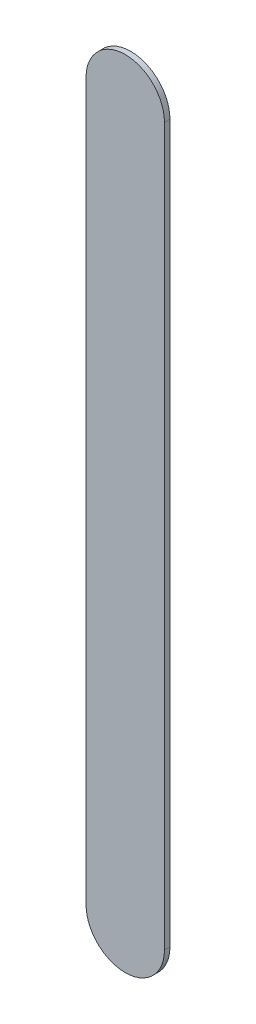
ISO-10303-21;
HEADER;
FILE_DESCRIPTION(('STEP AP214'),'2;1');
FILE_NAME('part.step','',(''),(''),'','','');
FILE_SCHEMA(('AUTOMOTIVE_DESIGN { 1 0 10303 214 1 1 1 1 }'));
ENDSEC;
DATA;
#1=APPLICATION_CONTEXT('core data for automotive mechanical design processes');
#2=APPLICATION_PROTOCOL_DEFINITION('international standard','automotive_design',2000,#1);
#3=PRODUCT_CONTEXT('',#1,'mechanical');
#4=PRODUCT('Part','Part','',(#3));
#5=PRODUCT_RELATED_PRODUCT_CATEGORY('part','',(#4));
#6=PRODUCT_DEFINITION_FORMATION('','',#4);
#7=PRODUCT_DEFINITION_CONTEXT('part definition',#1,'design');
#8=PRODUCT_DEFINITION('design','',#6,#7);
#9=PRODUCT_DEFINITION_SHAPE('','',#8);
#10=(LENGTH_UNIT() NAMED_UNIT(*) SI_UNIT(.MILLI.,.METRE.));
#11=(NAMED_UNIT(*) PLANE_ANGLE_UNIT() SI_UNIT($,.RADIAN.));
#12=(NAMED_UNIT(*) SI_UNIT($,.STERADIAN.) SOLID_ANGLE_UNIT());
#13=UNCERTAINTY_MEASURE_WITH_UNIT(LENGTH_MEASURE(1.E-05),#10,'distance_accuracy_value','');
#14=(GEOMETRIC_REPRESENTATION_CONTEXT(3) GLOBAL_UNCERTAINTY_ASSIGNED_CONTEXT((#13)) GLOBAL_UNIT_ASSIGNED_CONTEXT((#10,
#11,#12)) REPRESENTATION_CONTEXT('',''));
#15=CARTESIAN_POINT('',(0.,0.,0.));
#16=DIRECTION('',(0.,0.,1.));
#17=DIRECTION('',(1.,0.,0.));
#18=AXIS2_PLACEMENT_3D('',#15,#16,#17);
#19=CARTESIAN_POINT('',(167.517,-126.365,0.));
#20=DIRECTION('',(0.,0.,1.));
#21=DIRECTION('',(1.,0.,0.));
#22=AXIS2_PLACEMENT_3D('',#19,#20,#21);
#23=PLANE('',#22);
#24=DIRECTION('',(0.,-1.,0.));
#25=VECTOR('',#24,1.);
#26=CARTESIAN_POINT('',(167.517,-126.365,0.));
#27=LINE('',#26,#25);
#28=CARTESIAN_POINT('',(167.517,-126.365,0.));
#29=VERTEX_POINT('',#28);
#30=CARTESIAN_POINT('',(167.517,-130.937,0.));
#31=VERTEX_POINT('',#30);
#32=EDGE_CURVE('E98',#29,#31,#27,.T.);
#33=ORIENTED_EDGE('',*,*,#32,.T.);
#34=CARTESIAN_POINT('',(167.767,-130.937,0.));
#35=DIRECTION('',(0.,0.,1.));
#36=DIRECTION('',(-1.,0.,0.));
#37=AXIS2_PLACEMENT_3D('',#34,#35,#36);
#38=CIRCLE('',#37,0.25);
#39=CARTESIAN_POINT('',(168.017,-130.937,0.));
#40=VERTEX_POINT('',#39);
#41=EDGE_CURVE('E77',#31,#40,#38,.T.);
#42=ORIENTED_EDGE('',*,*,#41,.T.);
#43=DIRECTION('',(0.,1.,0.));
#44=VECTOR('',#43,1.);
#45=CARTESIAN_POINT('',(168.017,-130.937,0.));
#46=LINE('',#45,#44);
#47=CARTESIAN_POINT('',(168.017,-126.365,0.));
#48=VERTEX_POINT('',#47);
#49=EDGE_CURVE('E82',#40,#48,#46,.T.);
#50=ORIENTED_EDGE('',*,*,#49,.T.);
#51=CARTESIAN_POINT('',(167.767,-126.365,0.));
#52=DIRECTION('',(0.,0.,1.));
#53=DIRECTION('',(1.,0.,0.));
#54=AXIS2_PLACEMENT_3D('',#51,#52,#53);
#55=CIRCLE('',#54,0.25);
#56=EDGE_CURVE('E11',#48,#29,#55,.T.);
#57=ORIENTED_EDGE('',*,*,#56,.T.);
#58=EDGE_LOOP('',(#33,#42,#50,#57));
#59=FACE_BOUND('',#58,.T.);
#60=ADVANCED_FACE('F17',(#59),#23,.T.);
#61=CARTESIAN_POINT('',(167.517,-126.365,-0.035));
#62=DIRECTION('',(0.,0.,1.));
#63=DIRECTION('',(1.,0.,0.));
#64=AXIS2_PLACEMENT_3D('',#61,#62,#63);
#65=PLANE('',#64);
#66=CARTESIAN_POINT('',(167.767,-126.365,-0.035));
#67=DIRECTION('',(0.,0.,1.));
#68=DIRECTION('',(1.,0.,0.));
#69=AXIS2_PLACEMENT_3D('',#66,#67,#68);
#70=CIRCLE('',#69,0.25);
#71=CARTESIAN_POINT('',(168.017,-126.365,-0.035));
#72=VERTEX_POINT('',#71);
#73=CARTESIAN_POINT('',(167.517,-126.365,-0.035));
#74=VERTEX_POINT('',#73);
#75=EDGE_CURVE('E25',#72,#74,#70,.T.);
#76=ORIENTED_EDGE('',*,*,#75,.F.);
#77=DIRECTION('',(0.,1.,0.));
#78=VECTOR('',#77,1.);
#79=CARTESIAN_POINT('',(168.017,-130.937,-0.035));
#80=LINE('',#79,#78);
#81=CARTESIAN_POINT('',(168.017,-130.937,-0.035));
#82=VERTEX_POINT('',#81);
#83=EDGE_CURVE('E67',#82,#72,#80,.T.);
#84=ORIENTED_EDGE('',*,*,#83,.F.);
#85=CARTESIAN_POINT('',(167.767,-130.937,-0.035));
#86=DIRECTION('',(0.,0.,1.));
#87=DIRECTION('',(-1.,0.,0.));
#88=AXIS2_PLACEMENT_3D('',#85,#86,#87);
#89=CIRCLE('',#88,0.25);
#90=CARTESIAN_POINT('',(167.517,-130.937,-0.035));
#91=VERTEX_POINT('',#90);
#92=EDGE_CURVE('E71',#91,#82,#89,.T.);
#93=ORIENTED_EDGE('',*,*,#92,.F.);
#94=DIRECTION('',(0.,-1.,0.));
#95=VECTOR('',#94,1.);
#96=CARTESIAN_POINT('',(167.517,-126.365,-0.035));
#97=LINE('',#96,#95);
#98=EDGE_CURVE('E114',#74,#91,#97,.T.);
#99=ORIENTED_EDGE('',*,*,#98,.F.);
#100=EDGE_LOOP('',(#76,#84,#93,#99));
#101=FACE_BOUND('',#100,.T.);
#102=ADVANCED_FACE('F69',(#101),#65,.F.);
#103=CARTESIAN_POINT('',(167.767,-126.365,-0.035));
#104=DIRECTION('',(0.,0.,-1.));
#105=DIRECTION('',(1.,0.,0.));
#106=AXIS2_PLACEMENT_3D('',#103,#104,#105);
#107=CYLINDRICAL_SURFACE('',#106,0.25);
#108=ORIENTED_EDGE('',*,*,#75,.T.);
#109=DIRECTION('',(0.,0.,1.));
#110=VECTOR('',#109,1.);
#111=CARTESIAN_POINT('',(167.517,-126.365,-0.035));
#112=LINE('',#111,#110);
#113=EDGE_CURVE('E92',#74,#29,#112,.T.);
#114=ORIENTED_EDGE('',*,*,#113,.T.);
#115=ORIENTED_EDGE('',*,*,#56,.F.);
#116=DIRECTION('',(0.,0.,1.));
#117=VECTOR('',#116,1.);
#118=CARTESIAN_POINT('',(168.017,-126.365,-0.035));
#119=LINE('',#118,#117);
#120=EDGE_CURVE('E76',#72,#48,#119,.T.);
#121=ORIENTED_EDGE('',*,*,#120,.F.);
#122=EDGE_LOOP('',(#108,#114,#115,#121));
#123=FACE_BOUND('',#122,.T.);
#124=ADVANCED_FACE('F110',(#123),#107,.T.);
#125=CARTESIAN_POINT('',(168.017,-130.937,-0.035));
#126=DIRECTION('',(-1.,0.,0.));
#127=DIRECTION('',(0.,0.,1.));
#128=AXIS2_PLACEMENT_3D('',#125,#126,#127);
#129=PLANE('',#128);
#130=ORIENTED_EDGE('',*,*,#83,.T.);
#131=ORIENTED_EDGE('',*,*,#120,.T.);
#132=ORIENTED_EDGE('',*,*,#49,.F.);
#133=DIRECTION('',(0.,0.,1.));
#134=VECTOR('',#133,1.);
#135=CARTESIAN_POINT('',(168.017,-130.937,-0.035));
#136=LINE('',#135,#134);
#137=EDGE_CURVE('E80',#82,#40,#136,.T.);
#138=ORIENTED_EDGE('',*,*,#137,.F.);
#139=EDGE_LOOP('',(#130,#131,#132,#138));
#140=FACE_BOUND('',#139,.T.);
#141=ADVANCED_FACE('F81',(#140),#129,.F.);
#142=CARTESIAN_POINT('',(167.767,-130.937,-0.035));
#143=DIRECTION('',(0.,0.,-1.));
#144=DIRECTION('',(-1.,0.,0.));
#145=AXIS2_PLACEMENT_3D('',#142,#143,#144);
#146=CYLINDRICAL_SURFACE('',#145,0.25);
#147=ORIENTED_EDGE('',*,*,#92,.T.);
#148=ORIENTED_EDGE('',*,*,#137,.T.);
#149=ORIENTED_EDGE('',*,*,#41,.F.);
#150=DIRECTION('',(0.,0.,1.));
#151=VECTOR('',#150,1.);
#152=CARTESIAN_POINT('',(167.517,-130.937,-0.035));
#153=LINE('',#152,#151);
#154=EDGE_CURVE('E89',#91,#31,#153,.T.);
#155=ORIENTED_EDGE('',*,*,#154,.F.);
#156=EDGE_LOOP('',(#147,#148,#149,#155));
#157=FACE_BOUND('',#156,.T.);
#158=ADVANCED_FACE('F87',(#157),#146,.T.);
#159=CARTESIAN_POINT('',(167.517,-126.365,-0.035));
#160=DIRECTION('',(1.,0.,0.));
#161=DIRECTION('',(0.,1.,0.));
#162=AXIS2_PLACEMENT_3D('',#159,#160,#161);
#163=PLANE('',#162);
#164=ORIENTED_EDGE('',*,*,#98,.T.);
#165=ORIENTED_EDGE('',*,*,#154,.T.);
#166=ORIENTED_EDGE('',*,*,#32,.F.);
#167=ORIENTED_EDGE('',*,*,#113,.F.);
#168=EDGE_LOOP('',(#164,#165,#166,#167));
#169=FACE_BOUND('',#168,.T.);
#170=ADVANCED_FACE('F113',(#169),#163,.F.);
#171=CLOSED_SHELL('',(#60,#102,#124,#141,#158,#170));
#172=MANIFOLD_SOLID_BREP('B1',#171);
#173=ADVANCED_BREP_SHAPE_REPRESENTATION('',(#18,#172),#14);
#174=SHAPE_DEFINITION_REPRESENTATION(#9,#173);
ENDSEC;
END-ISO-10303-21;
